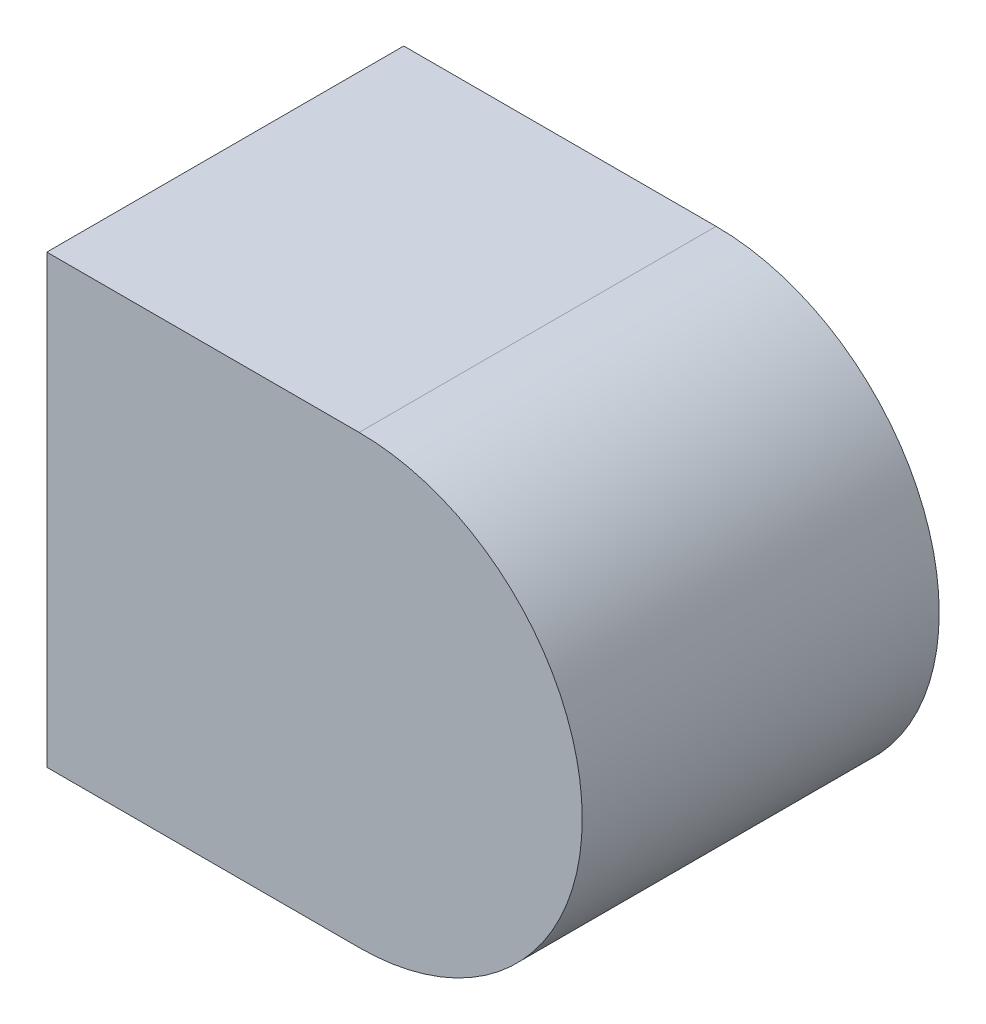
ISO-10303-21;
HEADER;
FILE_DESCRIPTION(('STEP AP214'),'2;1');
FILE_NAME('part.step','',(''),(''),'','','');
FILE_SCHEMA(('AUTOMOTIVE_DESIGN { 1 0 10303 214 1 1 1 1 }'));
ENDSEC;
DATA;
#1=APPLICATION_CONTEXT('core data for automotive mechanical design processes');
#2=APPLICATION_PROTOCOL_DEFINITION('international standard','automotive_design',2000,#1);
#3=PRODUCT_CONTEXT('',#1,'mechanical');
#4=PRODUCT('Part','Part','',(#3));
#5=PRODUCT_RELATED_PRODUCT_CATEGORY('part','',(#4));
#6=PRODUCT_DEFINITION_FORMATION('','',#4);
#7=PRODUCT_DEFINITION_CONTEXT('part definition',#1,'design');
#8=PRODUCT_DEFINITION('design','',#6,#7);
#9=PRODUCT_DEFINITION_SHAPE('','',#8);
#10=(LENGTH_UNIT() NAMED_UNIT(*) SI_UNIT(.MILLI.,.METRE.));
#11=(NAMED_UNIT(*) PLANE_ANGLE_UNIT() SI_UNIT($,.RADIAN.));
#12=(NAMED_UNIT(*) SI_UNIT($,.STERADIAN.) SOLID_ANGLE_UNIT());
#13=UNCERTAINTY_MEASURE_WITH_UNIT(LENGTH_MEASURE(1.E-05),#10,'distance_accuracy_value','');
#14=(GEOMETRIC_REPRESENTATION_CONTEXT(3) GLOBAL_UNCERTAINTY_ASSIGNED_CONTEXT((#13)) GLOBAL_UNIT_ASSIGNED_CONTEXT((#10,
#11,#12)) REPRESENTATION_CONTEXT('',''));
#15=CARTESIAN_POINT('',(0.,0.,0.));
#16=DIRECTION('',(0.,0.,1.));
#17=DIRECTION('',(1.,0.,0.));
#18=AXIS2_PLACEMENT_3D('',#15,#16,#17);
#19=CARTESIAN_POINT('',(-0.703,0.875,0.));
#20=DIRECTION('',(0.,1.,0.));
#21=DIRECTION('',(-1.,0.,0.));
#22=AXIS2_PLACEMENT_3D('',#19,#20,#21);
#23=PLANE('',#22);
#24=DIRECTION('',(0.,0.,1.));
#25=VECTOR('',#24,1.);
#26=CARTESIAN_POINT('',(-0.828,0.875,0.));
#27=LINE('',#26,#25);
#28=CARTESIAN_POINT('',(-0.828,0.875,0.));
#29=VERTEX_POINT('',#28);
#30=CARTESIAN_POINT('',(-0.828,0.875,0.2));
#31=VERTEX_POINT('',#30);
#32=EDGE_CURVE('E11',#29,#31,#27,.T.);
#33=ORIENTED_EDGE('',*,*,#32,.F.);
#34=DIRECTION('',(-1.,0.,0.));
#35=VECTOR('',#34,1.);
#36=CARTESIAN_POINT('',(-0.703,0.875,0.));
#37=LINE('',#36,#35);
#38=CARTESIAN_POINT('',(-1.003,0.875,0.));
#39=VERTEX_POINT('',#38);
#40=EDGE_CURVE('E24',#29,#39,#37,.T.);
#41=ORIENTED_EDGE('',*,*,#40,.T.);
#42=DIRECTION('',(0.,0.,1.));
#43=VECTOR('',#42,1.);
#44=CARTESIAN_POINT('',(-1.003,0.875,0.));
#45=LINE('',#44,#43);
#46=CARTESIAN_POINT('',(-1.003,0.875,0.2));
#47=VERTEX_POINT('',#46);
#48=EDGE_CURVE('E88',#39,#47,#45,.T.);
#49=ORIENTED_EDGE('',*,*,#48,.T.);
#50=DIRECTION('',(-1.,0.,0.));
#51=VECTOR('',#50,1.);
#52=CARTESIAN_POINT('',(-0.703,0.875,0.2));
#53=LINE('',#52,#51);
#54=EDGE_CURVE('E76',#31,#47,#53,.T.);
#55=ORIENTED_EDGE('',*,*,#54,.F.);
#56=EDGE_LOOP('',(#33,#41,#49,#55));
#57=FACE_BOUND('',#56,.T.);
#58=ADVANCED_FACE('F17',(#57),#23,.T.);
#59=CARTESIAN_POINT('',(-0.853,0.75,0.));
#60=DIRECTION('',(0.,0.,1.));
#61=DIRECTION('',(1.,0.,0.));
#62=AXIS2_PLACEMENT_3D('',#59,#60,#61);
#63=PLANE('',#62);
#64=CARTESIAN_POINT('',(-0.828,0.75,0.));
#65=DIRECTION('',(0.,0.,1.));
#66=DIRECTION('',(0.707106781186548,0.707106781186547,0.));
#67=AXIS2_PLACEMENT_3D('',#64,#65,#66);
#68=CIRCLE('',#67,0.125);
#69=CARTESIAN_POINT('',(-0.828,0.625,0.));
#70=VERTEX_POINT('',#69);
#71=EDGE_CURVE('E85',#70,#29,#68,.T.);
#72=ORIENTED_EDGE('',*,*,#71,.F.);
#73=DIRECTION('',(1.,0.,0.));
#74=VECTOR('',#73,1.);
#75=CARTESIAN_POINT('',(-1.003,0.625,0.));
#76=LINE('',#75,#74);
#77=CARTESIAN_POINT('',(-1.003,0.625,0.));
#78=VERTEX_POINT('',#77);
#79=EDGE_CURVE('E83',#78,#70,#76,.T.);
#80=ORIENTED_EDGE('',*,*,#79,.F.);
#81=DIRECTION('',(0.,-1.,0.));
#82=VECTOR('',#81,1.);
#83=CARTESIAN_POINT('',(-1.003,0.875,0.));
#84=LINE('',#83,#82);
#85=EDGE_CURVE('E72',#39,#78,#84,.T.);
#86=ORIENTED_EDGE('',*,*,#85,.F.);
#87=ORIENTED_EDGE('',*,*,#40,.F.);
#88=EDGE_LOOP('',(#72,#80,#86,#87));
#89=FACE_BOUND('',#88,.T.);
#90=ADVANCED_FACE('F90',(#89),#63,.F.);
#91=CARTESIAN_POINT('',(-0.828,0.75,0.));
#92=DIRECTION('',(0.,0.,1.));
#93=DIRECTION('',(0.707106781186547,-0.707106781186548,0.));
#94=AXIS2_PLACEMENT_3D('',#91,#92,#93);
#95=CYLINDRICAL_SURFACE('',#94,0.125);
#96=CARTESIAN_POINT('',(-0.828,0.75,0.2));
#97=DIRECTION('',(0.,0.,-1.));
#98=DIRECTION('',(0.707106781186548,0.707106781186547,0.));
#99=AXIS2_PLACEMENT_3D('',#96,#97,#98);
#100=CIRCLE('',#99,0.125);
#101=CARTESIAN_POINT('',(-0.828,0.625,0.2));
#102=VERTEX_POINT('',#101);
#103=EDGE_CURVE('E80',#31,#102,#100,.T.);
#104=ORIENTED_EDGE('',*,*,#103,.T.);
#105=DIRECTION('',(0.,0.,-1.));
#106=VECTOR('',#105,1.);
#107=CARTESIAN_POINT('',(-0.828,0.625,0.));
#108=LINE('',#107,#106);
#109=EDGE_CURVE('E60',#102,#70,#108,.T.);
#110=ORIENTED_EDGE('',*,*,#109,.T.);
#111=ORIENTED_EDGE('',*,*,#71,.T.);
#112=ORIENTED_EDGE('',*,*,#32,.T.);
#113=EDGE_LOOP('',(#104,#110,#111,#112));
#114=FACE_BOUND('',#113,.T.);
#115=ADVANCED_FACE('F91',(#114),#95,.T.);
#116=CARTESIAN_POINT('',(-1.003,0.625,0.));
#117=DIRECTION('',(0.,-1.,0.));
#118=DIRECTION('',(1.,0.,0.));
#119=AXIS2_PLACEMENT_3D('',#116,#117,#118);
#120=PLANE('',#119);
#121=ORIENTED_EDGE('',*,*,#109,.F.);
#122=DIRECTION('',(1.,0.,0.));
#123=VECTOR('',#122,1.);
#124=CARTESIAN_POINT('',(-1.003,0.625,0.2));
#125=LINE('',#124,#123);
#126=CARTESIAN_POINT('',(-1.003,0.625,0.2));
#127=VERTEX_POINT('',#126);
#128=EDGE_CURVE('E54',#127,#102,#125,.T.);
#129=ORIENTED_EDGE('',*,*,#128,.F.);
#130=DIRECTION('',(0.,0.,1.));
#131=VECTOR('',#130,1.);
#132=CARTESIAN_POINT('',(-1.003,0.625,0.));
#133=LINE('',#132,#131);
#134=EDGE_CURVE('E58',#78,#127,#133,.T.);
#135=ORIENTED_EDGE('',*,*,#134,.F.);
#136=ORIENTED_EDGE('',*,*,#79,.T.);
#137=EDGE_LOOP('',(#121,#129,#135,#136));
#138=FACE_BOUND('',#137,.T.);
#139=ADVANCED_FACE('F56',(#138),#120,.T.);
#140=CARTESIAN_POINT('',(-1.003,0.875,0.));
#141=DIRECTION('',(-1.,0.,0.));
#142=DIRECTION('',(0.,-1.,0.));
#143=AXIS2_PLACEMENT_3D('',#140,#141,#142);
#144=PLANE('',#143);
#145=ORIENTED_EDGE('',*,*,#85,.T.);
#146=ORIENTED_EDGE('',*,*,#134,.T.);
#147=DIRECTION('',(0.,-1.,0.));
#148=VECTOR('',#147,1.);
#149=CARTESIAN_POINT('',(-1.003,0.875,0.2));
#150=LINE('',#149,#148);
#151=EDGE_CURVE('E70',#47,#127,#150,.T.);
#152=ORIENTED_EDGE('',*,*,#151,.F.);
#153=ORIENTED_EDGE('',*,*,#48,.F.);
#154=EDGE_LOOP('',(#145,#146,#152,#153));
#155=FACE_BOUND('',#154,.T.);
#156=ADVANCED_FACE('F68',(#155),#144,.T.);
#157=CARTESIAN_POINT('',(-0.853,0.75,0.2));
#158=DIRECTION('',(0.,0.,1.));
#159=DIRECTION('',(1.,0.,0.));
#160=AXIS2_PLACEMENT_3D('',#157,#158,#159);
#161=PLANE('',#160);
#162=ORIENTED_EDGE('',*,*,#103,.F.);
#163=ORIENTED_EDGE('',*,*,#54,.T.);
#164=ORIENTED_EDGE('',*,*,#151,.T.);
#165=ORIENTED_EDGE('',*,*,#128,.T.);
#166=EDGE_LOOP('',(#162,#163,#164,#165));
#167=FACE_BOUND('',#166,.T.);
#168=ADVANCED_FACE('F75',(#167),#161,.T.);
#169=CLOSED_SHELL('',(#58,#90,#115,#139,#156,#168));
#170=MANIFOLD_SOLID_BREP('B1',#169);
#171=ADVANCED_BREP_SHAPE_REPRESENTATION('',(#18,#170),#14);
#172=SHAPE_DEFINITION_REPRESENTATION(#9,#171);
ENDSEC;
END-ISO-10303-21;
